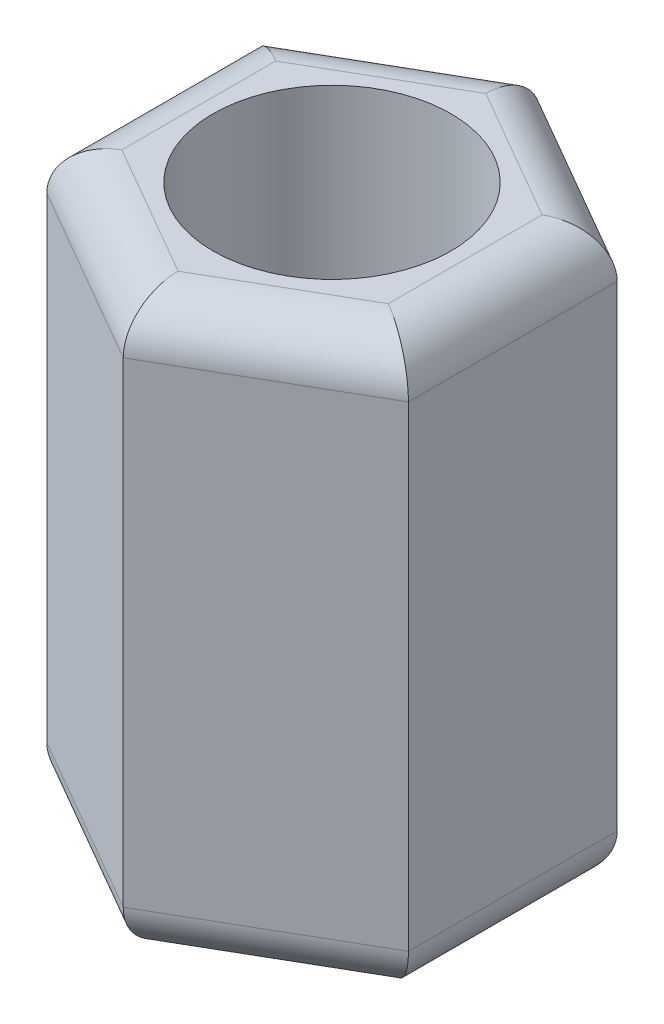
ISO-10303-21;
HEADER;
FILE_DESCRIPTION(('STEP AP214'),'2;1');
FILE_NAME('part.step','',(''),(''),'','','');
FILE_SCHEMA(('AUTOMOTIVE_DESIGN { 1 0 10303 214 1 1 1 1 }'));
ENDSEC;
DATA;
#1=APPLICATION_CONTEXT('core data for automotive mechanical design processes');
#2=APPLICATION_PROTOCOL_DEFINITION('international standard','automotive_design',2000,#1);
#3=PRODUCT_CONTEXT('',#1,'mechanical');
#4=PRODUCT('Part','Part','',(#3));
#5=PRODUCT_RELATED_PRODUCT_CATEGORY('part','',(#4));
#6=PRODUCT_DEFINITION_FORMATION('','',#4);
#7=PRODUCT_DEFINITION_CONTEXT('part definition',#1,'design');
#8=PRODUCT_DEFINITION('design','',#6,#7);
#9=PRODUCT_DEFINITION_SHAPE('','',#8);
#10=(LENGTH_UNIT() NAMED_UNIT(*) SI_UNIT(.MILLI.,.METRE.));
#11=(NAMED_UNIT(*) PLANE_ANGLE_UNIT() SI_UNIT($,.RADIAN.));
#12=(NAMED_UNIT(*) SI_UNIT($,.STERADIAN.) SOLID_ANGLE_UNIT());
#13=UNCERTAINTY_MEASURE_WITH_UNIT(LENGTH_MEASURE(1.E-05),#10,'distance_accuracy_value','');
#14=(GEOMETRIC_REPRESENTATION_CONTEXT(3) GLOBAL_UNCERTAINTY_ASSIGNED_CONTEXT((#13)) GLOBAL_UNIT_ASSIGNED_CONTEXT((#10,
#11,#12)) REPRESENTATION_CONTEXT('',''));
#15=CARTESIAN_POINT('',(0.,0.,0.));
#16=DIRECTION('',(0.,0.,1.));
#17=DIRECTION('',(1.,0.,0.));
#18=AXIS2_PLACEMENT_3D('',#15,#16,#17);
#19=CARTESIAN_POINT('',(0.,6.,0.));
#20=DIRECTION('',(0.,1.,0.));
#21=DIRECTION('',(0.,0.,1.));
#22=AXIS2_PLACEMENT_3D('',#19,#20,#21);
#23=PLANE('',#22);
#24=DIRECTION('',(0.,0.,1.));
#25=VECTOR('',#24,1.);
#26=CARTESIAN_POINT('',(-1.4,6.,1.09696551146029));
#27=LINE('',#26,#25);
#28=CARTESIAN_POINT('',(-1.4,6.,-0.808290376865477));
#29=VERTEX_POINT('',#28);
#30=CARTESIAN_POINT('',(-1.4,6.,0.808290376865476));
#31=VERTEX_POINT('',#30);
#32=EDGE_CURVE('E44',#29,#31,#27,.T.);
#33=ORIENTED_EDGE('',*,*,#32,.T.);
#34=DIRECTION('',(0.866025403784439,0.,0.5));
#35=VECTOR('',#34,1.);
#36=CARTESIAN_POINT('',(0.25,6.,1.76091832102836));
#37=LINE('',#36,#35);
#38=CARTESIAN_POINT('',(0.,6.,1.61658075373095));
#39=VERTEX_POINT('',#38);
#40=EDGE_CURVE('E11',#31,#39,#37,.T.);
#41=ORIENTED_EDGE('',*,*,#40,.T.);
#42=DIRECTION('',(0.866025403784439,0.,-0.5));
#43=VECTOR('',#42,1.);
#44=CARTESIAN_POINT('',(1.65,6.,0.663952809568071));
#45=LINE('',#44,#43);
#46=CARTESIAN_POINT('',(1.4,6.,0.808290376865478));
#47=VERTEX_POINT('',#46);
#48=EDGE_CURVE('E160',#39,#47,#45,.T.);
#49=ORIENTED_EDGE('',*,*,#48,.T.);
#50=DIRECTION('',(0.,0.,-1.));
#51=VECTOR('',#50,1.);
#52=CARTESIAN_POINT('',(1.4,6.,-1.09696551146029));
#53=LINE('',#52,#51);
#54=CARTESIAN_POINT('',(1.4,6.,-0.808290376865478));
#55=VERTEX_POINT('',#54);
#56=EDGE_CURVE('E257',#47,#55,#53,.T.);
#57=ORIENTED_EDGE('',*,*,#56,.T.);
#58=DIRECTION('',(-0.866025403784439,0.,-0.5));
#59=VECTOR('',#58,1.);
#60=CARTESIAN_POINT('',(-0.250000000000001,6.,-1.76091832102836));
#61=LINE('',#60,#59);
#62=CARTESIAN_POINT('',(0.,6.,-1.61658075373095));
#63=VERTEX_POINT('',#62);
#64=EDGE_CURVE('E259',#55,#63,#61,.T.);
#65=ORIENTED_EDGE('',*,*,#64,.T.);
#66=DIRECTION('',(-0.866025403784439,0.,0.5));
#67=VECTOR('',#66,1.);
#68=CARTESIAN_POINT('',(-1.65,6.,-0.663952809568071));
#69=LINE('',#68,#67);
#70=EDGE_CURVE('E55',#63,#29,#69,.T.);
#71=ORIENTED_EDGE('',*,*,#70,.T.);
#72=EDGE_LOOP('',(#33,#41,#49,#57,#65,#71));
#73=FACE_BOUND('',#72,.T.);
#74=CARTESIAN_POINT('',(0.,6.,0.));
#75=DIRECTION('',(0.,1.,0.));
#76=DIRECTION('',(0.,0.,1.));
#77=AXIS2_PLACEMENT_3D('',#74,#75,#76);
#78=CIRCLE('',#77,1.25);
#79=CARTESIAN_POINT('',(0.,6.,1.25));
#80=VERTEX_POINT('',#79);
#81=EDGE_CURVE('E149',#80,#80,#78,.T.);
#82=ORIENTED_EDGE('',*,*,#81,.F.);
#83=EDGE_LOOP('',(#82));
#84=FACE_BOUND('',#83,.T.);
#85=ADVANCED_FACE('F35',(#73,#84),#23,.T.);
#86=CARTESIAN_POINT('',(0.,0.,0.));
#87=DIRECTION('',(0.,1.,0.));
#88=DIRECTION('',(0.,0.,1.));
#89=AXIS2_PLACEMENT_3D('',#86,#87,#88);
#90=PLANE('',#89);
#91=DIRECTION('',(0.866025403784439,0.,-0.5));
#92=VECTOR('',#91,1.);
#93=CARTESIAN_POINT('',(0.7,0.,1.21243556529821));
#94=LINE('',#93,#92);
#95=CARTESIAN_POINT('',(1.4,0.,0.808290376865477));
#96=VERTEX_POINT('',#95);
#97=CARTESIAN_POINT('',(0.,0.,1.61658075373095));
#98=VERTEX_POINT('',#97);
#99=EDGE_CURVE('E235',#96,#98,#94,.F.);
#100=ORIENTED_EDGE('',*,*,#99,.T.);
#101=DIRECTION('',(0.866025403784439,0.,0.5));
#102=VECTOR('',#101,1.);
#103=CARTESIAN_POINT('',(-0.700000000000001,0.,1.21243556529821));
#104=LINE('',#103,#102);
#105=CARTESIAN_POINT('',(-1.4,0.,0.808290376865476));
#106=VERTEX_POINT('',#105);
#107=EDGE_CURVE('E136',#98,#106,#104,.F.);
#108=ORIENTED_EDGE('',*,*,#107,.T.);
#109=DIRECTION('',(0.,0.,1.));
#110=VECTOR('',#109,1.);
#111=CARTESIAN_POINT('',(-1.4,0.,0.));
#112=LINE('',#111,#110);
#113=CARTESIAN_POINT('',(-1.4,0.,-0.808290376865478));
#114=VERTEX_POINT('',#113);
#115=EDGE_CURVE('E227',#106,#114,#112,.F.);
#116=ORIENTED_EDGE('',*,*,#115,.T.);
#117=DIRECTION('',(-0.866025403784439,0.,0.5));
#118=VECTOR('',#117,1.);
#119=CARTESIAN_POINT('',(-0.700000000000001,0.,-1.21243556529822));
#120=LINE('',#119,#118);
#121=CARTESIAN_POINT('',(0.,0.,-1.61658075373095));
#122=VERTEX_POINT('',#121);
#123=EDGE_CURVE('E229',#114,#122,#120,.F.);
#124=ORIENTED_EDGE('',*,*,#123,.T.);
#125=DIRECTION('',(-0.866025403784439,0.,-0.5));
#126=VECTOR('',#125,1.);
#127=CARTESIAN_POINT('',(0.7,0.,-1.21243556529821));
#128=LINE('',#127,#126);
#129=CARTESIAN_POINT('',(1.4,0.,-0.808290376865478));
#130=VERTEX_POINT('',#129);
#131=EDGE_CURVE('E231',#122,#130,#128,.F.);
#132=ORIENTED_EDGE('',*,*,#131,.T.);
#133=DIRECTION('',(0.,0.,-1.));
#134=VECTOR('',#133,1.);
#135=CARTESIAN_POINT('',(1.4,0.,0.));
#136=LINE('',#135,#134);
#137=EDGE_CURVE('E233',#130,#96,#136,.F.);
#138=ORIENTED_EDGE('',*,*,#137,.T.);
#139=EDGE_LOOP('',(#100,#108,#116,#124,#132,#138));
#140=FACE_BOUND('',#139,.T.);
#141=CARTESIAN_POINT('',(0.,0.,0.));
#142=DIRECTION('',(0.,1.,0.));
#143=DIRECTION('',(0.,0.,1.));
#144=AXIS2_PLACEMENT_3D('',#141,#142,#143);
#145=CIRCLE('',#144,1.25);
#146=CARTESIAN_POINT('',(0.,0.,1.25));
#147=VERTEX_POINT('',#146);
#148=EDGE_CURVE('E203',#147,#147,#145,.T.);
#149=ORIENTED_EDGE('',*,*,#148,.T.);
#150=EDGE_LOOP('',(#149));
#151=FACE_BOUND('',#150,.T.);
#152=ADVANCED_FACE('F303',(#140,#151),#90,.F.);
#153=CARTESIAN_POINT('',(0.,6.,2.19393102292058));
#154=DIRECTION('',(-0.5,0.,-0.866025403784439));
#155=DIRECTION('',(-0.866025403784439,0.,0.5));
#156=AXIS2_PLACEMENT_3D('',#153,#154,#155);
#157=PLANE('',#156);
#158=DIRECTION('',(0.,-1.,0.));
#159=VECTOR('',#158,1.);
#160=CARTESIAN_POINT('',(0.,6.,2.19393102292058));
#161=LINE('',#160,#159);
#162=CARTESIAN_POINT('',(0.,5.5,2.19393102292058));
#163=VERTEX_POINT('',#162);
#164=CARTESIAN_POINT('',(0.,0.5,2.19393102292058));
#165=VERTEX_POINT('',#164);
#166=EDGE_CURVE('E128',#163,#165,#161,.T.);
#167=ORIENTED_EDGE('',*,*,#166,.T.);
#168=DIRECTION('',(0.866025403784439,0.,-0.5));
#169=VECTOR('',#168,1.);
#170=CARTESIAN_POINT('',(0.,0.5,2.19393102292058));
#171=LINE('',#170,#169);
#172=CARTESIAN_POINT('',(1.9,0.5,1.09696551146029));
#173=VERTEX_POINT('',#172);
#174=EDGE_CURVE('E135',#165,#173,#171,.T.);
#175=ORIENTED_EDGE('',*,*,#174,.T.);
#176=DIRECTION('',(0.,-1.,0.));
#177=VECTOR('',#176,1.);
#178=CARTESIAN_POINT('',(1.9,6.,1.09696551146029));
#179=LINE('',#178,#177);
#180=CARTESIAN_POINT('',(1.9,5.5,1.09696551146029));
#181=VERTEX_POINT('',#180);
#182=EDGE_CURVE('E130',#181,#173,#179,.T.);
#183=ORIENTED_EDGE('',*,*,#182,.F.);
#184=DIRECTION('',(0.866025403784439,0.,-0.5));
#185=VECTOR('',#184,1.);
#186=CARTESIAN_POINT('',(0.,5.5,2.19393102292058));
#187=LINE('',#186,#185);
#188=EDGE_CURVE('E125',#181,#163,#187,.F.);
#189=ORIENTED_EDGE('',*,*,#188,.T.);
#190=EDGE_LOOP('',(#167,#175,#183,#189));
#191=FACE_BOUND('',#190,.T.);
#192=ADVANCED_FACE('F127',(#191),#157,.F.);
#193=CARTESIAN_POINT('',(1.9,6.,1.09696551146029));
#194=DIRECTION('',(-1.,0.,0.));
#195=DIRECTION('',(0.,0.,1.));
#196=AXIS2_PLACEMENT_3D('',#193,#194,#195);
#197=PLANE('',#196);
#198=ORIENTED_EDGE('',*,*,#182,.T.);
#199=DIRECTION('',(0.,0.,-1.));
#200=VECTOR('',#199,1.);
#201=CARTESIAN_POINT('',(1.9,0.5,1.09696551146029));
#202=LINE('',#201,#200);
#203=CARTESIAN_POINT('',(1.9,0.5,-1.09696551146029));
#204=VERTEX_POINT('',#203);
#205=EDGE_CURVE('E242',#173,#204,#202,.T.);
#206=ORIENTED_EDGE('',*,*,#205,.T.);
#207=DIRECTION('',(0.,-1.,0.));
#208=VECTOR('',#207,1.);
#209=CARTESIAN_POINT('',(1.9,6.,-1.09696551146029));
#210=LINE('',#209,#208);
#211=CARTESIAN_POINT('',(1.9,5.5,-1.09696551146029));
#212=VERTEX_POINT('',#211);
#213=EDGE_CURVE('E222',#212,#204,#210,.T.);
#214=ORIENTED_EDGE('',*,*,#213,.F.);
#215=DIRECTION('',(0.,0.,-1.));
#216=VECTOR('',#215,1.);
#217=CARTESIAN_POINT('',(1.9,5.5,1.09696551146029));
#218=LINE('',#217,#216);
#219=EDGE_CURVE('E240',#212,#181,#218,.F.);
#220=ORIENTED_EDGE('',*,*,#219,.T.);
#221=EDGE_LOOP('',(#198,#206,#214,#220));
#222=FACE_BOUND('',#221,.T.);
#223=ADVANCED_FACE('F271',(#222),#197,.F.);
#224=CARTESIAN_POINT('',(1.9,6.,-1.09696551146029));
#225=DIRECTION('',(-0.5,0.,0.866025403784439));
#226=DIRECTION('',(0.866025403784439,0.,0.5));
#227=AXIS2_PLACEMENT_3D('',#224,#225,#226);
#228=PLANE('',#227);
#229=ORIENTED_EDGE('',*,*,#213,.T.);
#230=DIRECTION('',(-0.866025403784439,0.,-0.5));
#231=VECTOR('',#230,1.);
#232=CARTESIAN_POINT('',(1.9,0.5,-1.09696551146029));
#233=LINE('',#232,#231);
#234=CARTESIAN_POINT('',(0.,0.5,-2.19393102292058));
#235=VERTEX_POINT('',#234);
#236=EDGE_CURVE('E246',#204,#235,#233,.T.);
#237=ORIENTED_EDGE('',*,*,#236,.T.);
#238=DIRECTION('',(0.,-1.,0.));
#239=VECTOR('',#238,1.);
#240=CARTESIAN_POINT('',(0.,6.,-2.19393102292058));
#241=LINE('',#240,#239);
#242=CARTESIAN_POINT('',(0.,5.5,-2.19393102292058));
#243=VERTEX_POINT('',#242);
#244=EDGE_CURVE('E219',#243,#235,#241,.T.);
#245=ORIENTED_EDGE('',*,*,#244,.F.);
#246=DIRECTION('',(-0.866025403784439,0.,-0.5));
#247=VECTOR('',#246,1.);
#248=CARTESIAN_POINT('',(1.9,5.5,-1.09696551146029));
#249=LINE('',#248,#247);
#250=EDGE_CURVE('E244',#243,#212,#249,.F.);
#251=ORIENTED_EDGE('',*,*,#250,.T.);
#252=EDGE_LOOP('',(#229,#237,#245,#251));
#253=FACE_BOUND('',#252,.T.);
#254=ADVANCED_FACE('F274',(#253),#228,.F.);
#255=CARTESIAN_POINT('',(0.,6.,-2.19393102292058));
#256=DIRECTION('',(0.5,0.,0.866025403784439));
#257=DIRECTION('',(0.866025403784439,0.,-0.5));
#258=AXIS2_PLACEMENT_3D('',#255,#256,#257);
#259=PLANE('',#258);
#260=ORIENTED_EDGE('',*,*,#244,.T.);
#261=DIRECTION('',(-0.866025403784439,0.,0.5));
#262=VECTOR('',#261,1.);
#263=CARTESIAN_POINT('',(0.,0.5,-2.19393102292058));
#264=LINE('',#263,#262);
#265=CARTESIAN_POINT('',(-1.9,0.5,-1.09696551146029));
#266=VERTEX_POINT('',#265);
#267=EDGE_CURVE('E250',#235,#266,#264,.T.);
#268=ORIENTED_EDGE('',*,*,#267,.T.);
#269=DIRECTION('',(0.,-1.,0.));
#270=VECTOR('',#269,1.);
#271=CARTESIAN_POINT('',(-1.9,6.,-1.09696551146029));
#272=LINE('',#271,#270);
#273=CARTESIAN_POINT('',(-1.9,5.5,-1.09696551146029));
#274=VERTEX_POINT('',#273);
#275=EDGE_CURVE('E216',#274,#266,#272,.T.);
#276=ORIENTED_EDGE('',*,*,#275,.F.);
#277=DIRECTION('',(-0.866025403784439,0.,0.5));
#278=VECTOR('',#277,1.);
#279=CARTESIAN_POINT('',(0.,5.5,-2.19393102292058));
#280=LINE('',#279,#278);
#281=EDGE_CURVE('E248',#274,#243,#280,.F.);
#282=ORIENTED_EDGE('',*,*,#281,.T.);
#283=EDGE_LOOP('',(#260,#268,#276,#282));
#284=FACE_BOUND('',#283,.T.);
#285=ADVANCED_FACE('F284',(#284),#259,.F.);
#286=CARTESIAN_POINT('',(-1.9,6.,-1.09696551146029));
#287=DIRECTION('',(1.,0.,0.));
#288=DIRECTION('',(0.,0.,-1.));
#289=AXIS2_PLACEMENT_3D('',#286,#287,#288);
#290=PLANE('',#289);
#291=ORIENTED_EDGE('',*,*,#275,.T.);
#292=DIRECTION('',(0.,0.,1.));
#293=VECTOR('',#292,1.);
#294=CARTESIAN_POINT('',(-1.9,0.5,-1.09696551146029));
#295=LINE('',#294,#293);
#296=CARTESIAN_POINT('',(-1.9,0.5,1.09696551146029));
#297=VERTEX_POINT('',#296);
#298=EDGE_CURVE('E254',#266,#297,#295,.T.);
#299=ORIENTED_EDGE('',*,*,#298,.T.);
#300=DIRECTION('',(0.,-1.,0.));
#301=VECTOR('',#300,1.);
#302=CARTESIAN_POINT('',(-1.9,6.,1.09696551146029));
#303=LINE('',#302,#301);
#304=CARTESIAN_POINT('',(-1.9,5.5,1.09696551146029));
#305=VERTEX_POINT('',#304);
#306=EDGE_CURVE('E148',#305,#297,#303,.T.);
#307=ORIENTED_EDGE('',*,*,#306,.F.);
#308=DIRECTION('',(0.,0.,1.));
#309=VECTOR('',#308,1.);
#310=CARTESIAN_POINT('',(-1.9,5.5,-1.09696551146029));
#311=LINE('',#310,#309);
#312=EDGE_CURVE('E252',#305,#274,#311,.F.);
#313=ORIENTED_EDGE('',*,*,#312,.T.);
#314=EDGE_LOOP('',(#291,#299,#307,#313));
#315=FACE_BOUND('',#314,.T.);
#316=ADVANCED_FACE('F286',(#315),#290,.F.);
#317=CARTESIAN_POINT('',(-1.9,6.,1.09696551146029));
#318=DIRECTION('',(0.5,0.,-0.866025403784439));
#319=DIRECTION('',(-0.866025403784439,0.,-0.5));
#320=AXIS2_PLACEMENT_3D('',#317,#318,#319);
#321=PLANE('',#320);
#322=ORIENTED_EDGE('',*,*,#306,.T.);
#323=DIRECTION('',(0.866025403784439,0.,0.5));
#324=VECTOR('',#323,1.);
#325=CARTESIAN_POINT('',(-1.9,0.5,1.09696551146029));
#326=LINE('',#325,#324);
#327=EDGE_CURVE('E147',#297,#165,#326,.T.);
#328=ORIENTED_EDGE('',*,*,#327,.T.);
#329=ORIENTED_EDGE('',*,*,#166,.F.);
#330=DIRECTION('',(0.866025403784439,0.,0.5));
#331=VECTOR('',#330,1.);
#332=CARTESIAN_POINT('',(-1.9,5.5,1.09696551146029));
#333=LINE('',#332,#331);
#334=EDGE_CURVE('E144',#163,#305,#333,.F.);
#335=ORIENTED_EDGE('',*,*,#334,.T.);
#336=EDGE_LOOP('',(#322,#328,#329,#335));
#337=FACE_BOUND('',#336,.T.);
#338=ADVANCED_FACE('F143',(#337),#321,.F.);
#339=CARTESIAN_POINT('',(0.,6.,0.));
#340=DIRECTION('',(0.,-1.,0.));
#341=DIRECTION('',(0.,0.,-1.));
#342=AXIS2_PLACEMENT_3D('',#339,#340,#341);
#343=CYLINDRICAL_SURFACE('',#342,1.25);
#344=ORIENTED_EDGE('',*,*,#81,.T.);
#345=EDGE_LOOP('',(#344));
#346=FACE_BOUND('',#345,.T.);
#347=ORIENTED_EDGE('',*,*,#148,.F.);
#348=EDGE_LOOP('',(#347));
#349=FACE_BOUND('',#348,.T.);
#350=ADVANCED_FACE('F311',(#346,#349),#343,.F.);
#351=CARTESIAN_POINT('',(1.65,0.5,-0.663952809568071));
#352=DIRECTION('',(-0.866025403784439,0.,-0.5));
#353=DIRECTION('',(-0.5,0.,0.866025403784439));
#354=AXIS2_PLACEMENT_3D('',#351,#352,#353);
#355=CYLINDRICAL_SURFACE('',#354,0.5);
#356=CARTESIAN_POINT('',(1.4,0.5,-0.808290376865478));
#357=DIRECTION('',(-0.5,0.,-0.866025403784438));
#358=DIRECTION('',(-0.866025403784439,0.,0.5));
#359=AXIS2_PLACEMENT_3D('',#356,#357,#358);
#360=ELLIPSE('',#359,0.577350269189626,0.5);
#361=EDGE_CURVE('E196',#130,#204,#360,.F.);
#362=ORIENTED_EDGE('',*,*,#361,.F.);
#363=ORIENTED_EDGE('',*,*,#131,.F.);
#364=CARTESIAN_POINT('',(0.,0.5,-1.61658075373095));
#365=DIRECTION('',(-1.,0.,0.));
#366=DIRECTION('',(0.,0.,1.));
#367=AXIS2_PLACEMENT_3D('',#364,#365,#366);
#368=ELLIPSE('',#367,0.577350269189626,0.5);
#369=EDGE_CURVE('E165',#235,#122,#368,.T.);
#370=ORIENTED_EDGE('',*,*,#369,.F.);
#371=ORIENTED_EDGE('',*,*,#236,.F.);
#372=EDGE_LOOP('',(#362,#363,#370,#371));
#373=FACE_BOUND('',#372,.T.);
#374=ADVANCED_FACE('F277',(#373),#355,.T.);
#375=CARTESIAN_POINT('',(0.249999999999999,0.5,-1.76091832102836));
#376=DIRECTION('',(-0.866025403784439,0.,0.5));
#377=DIRECTION('',(0.5,0.,0.866025403784439));
#378=AXIS2_PLACEMENT_3D('',#375,#376,#377);
#379=CYLINDRICAL_SURFACE('',#378,0.5);
#380=ORIENTED_EDGE('',*,*,#369,.T.);
#381=ORIENTED_EDGE('',*,*,#123,.F.);
#382=CARTESIAN_POINT('',(-1.4,0.5,-0.808290376865478));
#383=DIRECTION('',(-0.5,0.,0.866025403784439));
#384=DIRECTION('',(0.866025403784439,0.,0.5));
#385=AXIS2_PLACEMENT_3D('',#382,#383,#384);
#386=ELLIPSE('',#385,0.577350269189626,0.5);
#387=EDGE_CURVE('E194',#266,#114,#386,.T.);
#388=ORIENTED_EDGE('',*,*,#387,.F.);
#389=ORIENTED_EDGE('',*,*,#267,.F.);
#390=EDGE_LOOP('',(#380,#381,#388,#389));
#391=FACE_BOUND('',#390,.T.);
#392=ADVANCED_FACE('F280',(#391),#379,.T.);
#393=CARTESIAN_POINT('',(1.4,0.5,1.09696551146029));
#394=DIRECTION('',(0.,0.,-1.));
#395=DIRECTION('',(-1.,0.,0.));
#396=AXIS2_PLACEMENT_3D('',#393,#394,#395);
#397=CYLINDRICAL_SURFACE('',#396,0.5);
#398=ORIENTED_EDGE('',*,*,#361,.T.);
#399=ORIENTED_EDGE('',*,*,#205,.F.);
#400=CARTESIAN_POINT('',(1.4,0.5,0.808290376865477));
#401=DIRECTION('',(0.5,0.,-0.866025403784439));
#402=DIRECTION('',(-0.866025403784439,0.,-0.5));
#403=AXIS2_PLACEMENT_3D('',#400,#401,#402);
#404=ELLIPSE('',#403,0.577350269189626,0.5);
#405=EDGE_CURVE('E188',#96,#173,#404,.F.);
#406=ORIENTED_EDGE('',*,*,#405,.F.);
#407=ORIENTED_EDGE('',*,*,#137,.F.);
#408=EDGE_LOOP('',(#398,#399,#406,#407));
#409=FACE_BOUND('',#408,.T.);
#410=ADVANCED_FACE('F365',(#409),#397,.T.);
#411=CARTESIAN_POINT('',(-1.4,0.5,-1.09696551146029));
#412=DIRECTION('',(0.,0.,1.));
#413=DIRECTION('',(1.,0.,0.));
#414=AXIS2_PLACEMENT_3D('',#411,#412,#413);
#415=CYLINDRICAL_SURFACE('',#414,0.5);
#416=ORIENTED_EDGE('',*,*,#387,.T.);
#417=ORIENTED_EDGE('',*,*,#115,.F.);
#418=CARTESIAN_POINT('',(-1.4,0.5,0.808290376865476));
#419=DIRECTION('',(0.5,0.,0.866025403784439));
#420=DIRECTION('',(-0.866025403784439,0.,0.5));
#421=AXIS2_PLACEMENT_3D('',#418,#419,#420);
#422=ELLIPSE('',#421,0.577350269189626,0.5);
#423=EDGE_CURVE('E182',#297,#106,#422,.T.);
#424=ORIENTED_EDGE('',*,*,#423,.F.);
#425=ORIENTED_EDGE('',*,*,#298,.F.);
#426=EDGE_LOOP('',(#416,#417,#424,#425));
#427=FACE_BOUND('',#426,.T.);
#428=ADVANCED_FACE('F290',(#427),#415,.T.);
#429=CARTESIAN_POINT('',(-0.25,0.5,1.76091832102836));
#430=DIRECTION('',(0.866025403784439,0.,-0.5));
#431=DIRECTION('',(-0.5,0.,-0.866025403784439));
#432=AXIS2_PLACEMENT_3D('',#429,#430,#431);
#433=CYLINDRICAL_SURFACE('',#432,0.5);
#434=ORIENTED_EDGE('',*,*,#405,.T.);
#435=ORIENTED_EDGE('',*,*,#174,.F.);
#436=CARTESIAN_POINT('',(0.,0.5,1.61658075373095));
#437=DIRECTION('',(1.,0.,0.));
#438=DIRECTION('',(0.,0.,-1.));
#439=AXIS2_PLACEMENT_3D('',#436,#437,#438);
#440=ELLIPSE('',#439,0.577350269189626,0.5);
#441=EDGE_CURVE('E178',#98,#165,#440,.F.);
#442=ORIENTED_EDGE('',*,*,#441,.F.);
#443=ORIENTED_EDGE('',*,*,#99,.F.);
#444=EDGE_LOOP('',(#434,#435,#442,#443));
#445=FACE_BOUND('',#444,.T.);
#446=ADVANCED_FACE('F293',(#445),#433,.T.);
#447=CARTESIAN_POINT('',(-1.65,0.5,0.663952809568069));
#448=DIRECTION('',(0.866025403784439,0.,0.5));
#449=DIRECTION('',(0.5,0.,-0.866025403784439));
#450=AXIS2_PLACEMENT_3D('',#447,#448,#449);
#451=CYLINDRICAL_SURFACE('',#450,0.5);
#452=ORIENTED_EDGE('',*,*,#423,.T.);
#453=ORIENTED_EDGE('',*,*,#107,.F.);
#454=ORIENTED_EDGE('',*,*,#441,.T.);
#455=ORIENTED_EDGE('',*,*,#327,.F.);
#456=EDGE_LOOP('',(#452,#453,#454,#455));
#457=FACE_BOUND('',#456,.T.);
#458=ADVANCED_FACE('F291',(#457),#451,.T.);
#459=CARTESIAN_POINT('',(0.7,5.5,-1.21243556529821));
#460=DIRECTION('',(0.866025403784439,0.,0.5));
#461=DIRECTION('',(0.5,0.,-0.866025403784439));
#462=AXIS2_PLACEMENT_3D('',#459,#460,#461);
#463=CYLINDRICAL_SURFACE('',#462,0.5);
#464=CARTESIAN_POINT('',(1.4,5.5,-0.808290376865477));
#465=DIRECTION('',(0.5,0.,0.866025403784438));
#466=DIRECTION('',(-0.866025403784439,0.,0.5));
#467=AXIS2_PLACEMENT_3D('',#464,#465,#466);
#468=ELLIPSE('',#467,0.577350269189626,0.5);
#469=EDGE_CURVE('E171',#212,#55,#468,.T.);
#470=ORIENTED_EDGE('',*,*,#469,.F.);
#471=ORIENTED_EDGE('',*,*,#250,.F.);
#472=CARTESIAN_POINT('',(0.,5.5,-1.61658075373095));
#473=DIRECTION('',(1.,0.,0.));
#474=DIRECTION('',(0.,0.,1.));
#475=AXIS2_PLACEMENT_3D('',#472,#473,#474);
#476=ELLIPSE('',#475,0.577350269189626,0.5);
#477=EDGE_CURVE('E39',#63,#243,#476,.F.);
#478=ORIENTED_EDGE('',*,*,#477,.F.);
#479=ORIENTED_EDGE('',*,*,#64,.F.);
#480=EDGE_LOOP('',(#470,#471,#478,#479));
#481=FACE_BOUND('',#480,.T.);
#482=ADVANCED_FACE('F37',(#481),#463,.T.);
#483=CARTESIAN_POINT('',(-0.700000000000001,5.5,-1.21243556529822));
#484=DIRECTION('',(0.866025403784439,0.,-0.5));
#485=DIRECTION('',(-0.5,0.,-0.866025403784439));
#486=AXIS2_PLACEMENT_3D('',#483,#484,#485);
#487=CYLINDRICAL_SURFACE('',#486,0.5);
#488=ORIENTED_EDGE('',*,*,#477,.T.);
#489=ORIENTED_EDGE('',*,*,#281,.F.);
#490=CARTESIAN_POINT('',(-1.4,5.5,-0.808290376865478));
#491=DIRECTION('',(0.5,0.,-0.866025403784439));
#492=DIRECTION('',(0.866025403784439,0.,0.5));
#493=AXIS2_PLACEMENT_3D('',#490,#491,#492);
#494=ELLIPSE('',#493,0.577350269189626,0.5);
#495=EDGE_CURVE('E169',#29,#274,#494,.F.);
#496=ORIENTED_EDGE('',*,*,#495,.F.);
#497=ORIENTED_EDGE('',*,*,#70,.F.);
#498=EDGE_LOOP('',(#488,#489,#496,#497));
#499=FACE_BOUND('',#498,.T.);
#500=ADVANCED_FACE('F265',(#499),#487,.T.);
#501=CARTESIAN_POINT('',(1.4,5.5,0.));
#502=DIRECTION('',(0.,0.,1.));
#503=DIRECTION('',(1.,0.,0.));
#504=AXIS2_PLACEMENT_3D('',#501,#502,#503);
#505=CYLINDRICAL_SURFACE('',#504,0.5);
#506=ORIENTED_EDGE('',*,*,#469,.T.);
#507=ORIENTED_EDGE('',*,*,#56,.F.);
#508=CARTESIAN_POINT('',(1.4,5.5,0.808290376865477));
#509=DIRECTION('',(-0.5,0.,0.866025403784439));
#510=DIRECTION('',(-0.866025403784439,0.,-0.5));
#511=AXIS2_PLACEMENT_3D('',#508,#509,#510);
#512=ELLIPSE('',#511,0.577350269189626,0.5);
#513=EDGE_CURVE('E162',#181,#47,#512,.T.);
#514=ORIENTED_EDGE('',*,*,#513,.F.);
#515=ORIENTED_EDGE('',*,*,#219,.F.);
#516=EDGE_LOOP('',(#506,#507,#514,#515));
#517=FACE_BOUND('',#516,.T.);
#518=ADVANCED_FACE('F268',(#517),#505,.T.);
#519=CARTESIAN_POINT('',(-1.4,5.5,0.));
#520=DIRECTION('',(0.,0.,-1.));
#521=DIRECTION('',(-1.,0.,0.));
#522=AXIS2_PLACEMENT_3D('',#519,#520,#521);
#523=CYLINDRICAL_SURFACE('',#522,0.5);
#524=ORIENTED_EDGE('',*,*,#495,.T.);
#525=ORIENTED_EDGE('',*,*,#312,.F.);
#526=CARTESIAN_POINT('',(-1.4,5.5,0.808290376865476));
#527=DIRECTION('',(-0.5,0.,-0.866025403784439));
#528=DIRECTION('',(0.866025403784439,0.,-0.5));
#529=AXIS2_PLACEMENT_3D('',#526,#527,#528);
#530=ELLIPSE('',#529,0.577350269189626,0.5);
#531=EDGE_CURVE('E156',#31,#305,#530,.F.);
#532=ORIENTED_EDGE('',*,*,#531,.F.);
#533=ORIENTED_EDGE('',*,*,#32,.F.);
#534=EDGE_LOOP('',(#524,#525,#532,#533));
#535=FACE_BOUND('',#534,.T.);
#536=ADVANCED_FACE('F267',(#535),#523,.T.);
#537=CARTESIAN_POINT('',(0.7,5.5,1.21243556529821));
#538=DIRECTION('',(-0.866025403784439,0.,0.5));
#539=DIRECTION('',(0.5,0.,0.866025403784439));
#540=AXIS2_PLACEMENT_3D('',#537,#538,#539);
#541=CYLINDRICAL_SURFACE('',#540,0.5);
#542=ORIENTED_EDGE('',*,*,#513,.T.);
#543=ORIENTED_EDGE('',*,*,#48,.F.);
#544=CARTESIAN_POINT('',(0.,5.5,1.61658075373095));
#545=DIRECTION('',(-1.,0.,0.));
#546=DIRECTION('',(0.,0.,1.));
#547=AXIS2_PLACEMENT_3D('',#544,#545,#546);
#548=ELLIPSE('',#547,0.577350269189626,0.5);
#549=EDGE_CURVE('E154',#163,#39,#548,.T.);
#550=ORIENTED_EDGE('',*,*,#549,.F.);
#551=ORIENTED_EDGE('',*,*,#188,.F.);
#552=EDGE_LOOP('',(#542,#543,#550,#551));
#553=FACE_BOUND('',#552,.T.);
#554=ADVANCED_FACE('F159',(#553),#541,.T.);
#555=CARTESIAN_POINT('',(-0.700000000000001,5.5,1.21243556529821));
#556=DIRECTION('',(-0.866025403784439,0.,-0.5));
#557=DIRECTION('',(-0.5,0.,0.866025403784439));
#558=AXIS2_PLACEMENT_3D('',#555,#556,#557);
#559=CYLINDRICAL_SURFACE('',#558,0.5);
#560=ORIENTED_EDGE('',*,*,#531,.T.);
#561=ORIENTED_EDGE('',*,*,#334,.F.);
#562=ORIENTED_EDGE('',*,*,#549,.T.);
#563=ORIENTED_EDGE('',*,*,#40,.F.);
#564=EDGE_LOOP('',(#560,#561,#562,#563));
#565=FACE_BOUND('',#564,.T.);
#566=ADVANCED_FACE('F152',(#565),#559,.T.);
#567=CLOSED_SHELL('',(#85,#152,#192,#223,#254,#285,#316,#338,#350,#374,#392,#410,#428,#446,#458,
#482,#500,#518,#536,#554,#566));
#568=MANIFOLD_SOLID_BREP('B2',#567);
#569=ADVANCED_BREP_SHAPE_REPRESENTATION('',(#18,#568),#14);
#570=SHAPE_DEFINITION_REPRESENTATION(#9,#569);
ENDSEC;
END-ISO-10303-21;
